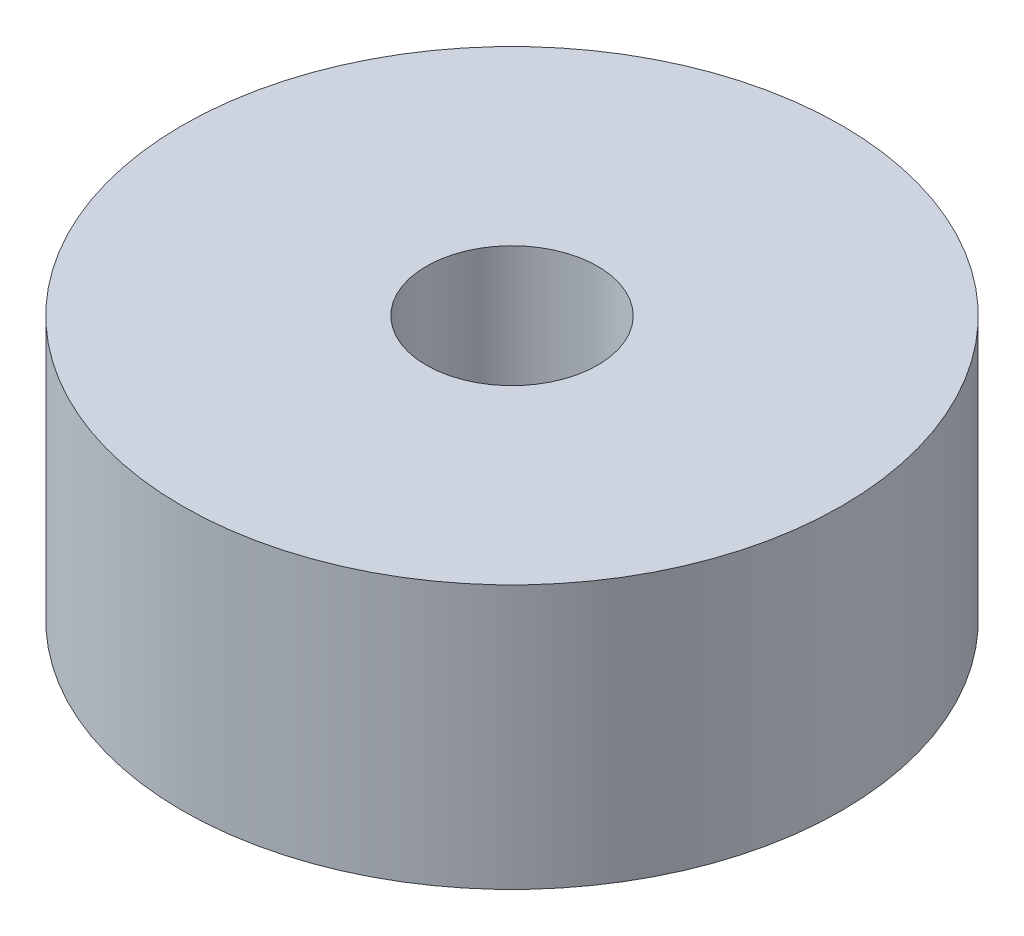
ISO-10303-21;
HEADER;
FILE_DESCRIPTION(('STEP AP214'),'2;1');
FILE_NAME('part.step','',(''),(''),'','','');
FILE_SCHEMA(('AUTOMOTIVE_DESIGN { 1 0 10303 214 1 1 1 1 }'));
ENDSEC;
DATA;
#1=APPLICATION_CONTEXT('core data for automotive mechanical design processes');
#2=APPLICATION_PROTOCOL_DEFINITION('international standard','automotive_design',2000,#1);
#3=PRODUCT_CONTEXT('',#1,'mechanical');
#4=PRODUCT('Part','Part','',(#3));
#5=PRODUCT_RELATED_PRODUCT_CATEGORY('part','',(#4));
#6=PRODUCT_DEFINITION_FORMATION('','',#4);
#7=PRODUCT_DEFINITION_CONTEXT('part definition',#1,'design');
#8=PRODUCT_DEFINITION('design','',#6,#7);
#9=PRODUCT_DEFINITION_SHAPE('','',#8);
#10=(LENGTH_UNIT() NAMED_UNIT(*) SI_UNIT(.MILLI.,.METRE.));
#11=(NAMED_UNIT(*) PLANE_ANGLE_UNIT() SI_UNIT($,.RADIAN.));
#12=(NAMED_UNIT(*) SI_UNIT($,.STERADIAN.) SOLID_ANGLE_UNIT());
#13=UNCERTAINTY_MEASURE_WITH_UNIT(LENGTH_MEASURE(1.E-05),#10,'distance_accuracy_value','');
#14=(GEOMETRIC_REPRESENTATION_CONTEXT(3) GLOBAL_UNCERTAINTY_ASSIGNED_CONTEXT((#13)) GLOBAL_UNIT_ASSIGNED_CONTEXT((#10,
#11,#12)) REPRESENTATION_CONTEXT('',''));
#15=CARTESIAN_POINT('',(0.,0.,0.));
#16=DIRECTION('',(0.,0.,1.));
#17=DIRECTION('',(1.,0.,0.));
#18=AXIS2_PLACEMENT_3D('',#15,#16,#17);
#19=CARTESIAN_POINT('',(0.,10.,0.));
#20=DIRECTION('',(0.,-1.,0.));
#21=DIRECTION('',(0.,0.,-1.));
#22=AXIS2_PLACEMENT_3D('',#19,#20,#21);
#23=CYLINDRICAL_SURFACE('',#22,12.5);
#24=CARTESIAN_POINT('',(0.,10.,0.));
#25=DIRECTION('',(0.,1.,0.));
#26=DIRECTION('',(0.,0.,1.));
#27=AXIS2_PLACEMENT_3D('',#24,#25,#26);
#28=CIRCLE('',#27,12.5);
#29=CARTESIAN_POINT('',(0.,10.,12.5));
#30=VERTEX_POINT('',#29);
#31=EDGE_CURVE('E10',#30,#30,#28,.T.);
#32=ORIENTED_EDGE('',*,*,#31,.F.);
#33=EDGE_LOOP('',(#32));
#34=FACE_BOUND('',#33,.T.);
#35=CARTESIAN_POINT('',(0.,0.,0.));
#36=DIRECTION('',(0.,1.,0.));
#37=DIRECTION('',(0.,0.,1.));
#38=AXIS2_PLACEMENT_3D('',#35,#36,#37);
#39=CIRCLE('',#38,12.5);
#40=CARTESIAN_POINT('',(0.,0.,12.5));
#41=VERTEX_POINT('',#40);
#42=EDGE_CURVE('E42',#41,#41,#39,.T.);
#43=ORIENTED_EDGE('',*,*,#42,.T.);
#44=EDGE_LOOP('',(#43));
#45=FACE_BOUND('',#44,.T.);
#46=ADVANCED_FACE('F39',(#34,#45),#23,.T.);
#47=CARTESIAN_POINT('',(0.,10.,0.));
#48=DIRECTION('',(0.,1.,0.));
#49=DIRECTION('',(0.,0.,1.));
#50=AXIS2_PLACEMENT_3D('',#47,#48,#49);
#51=PLANE('',#50);
#52=CARTESIAN_POINT('',(0.,10.,0.));
#53=DIRECTION('',(0.,1.,0.));
#54=DIRECTION('',(0.,0.,1.));
#55=AXIS2_PLACEMENT_3D('',#52,#53,#54);
#56=CIRCLE('',#55,3.25);
#57=CARTESIAN_POINT('',(0.,10.,3.25));
#58=VERTEX_POINT('',#57);
#59=EDGE_CURVE('E51',#58,#58,#56,.T.);
#60=ORIENTED_EDGE('',*,*,#59,.F.);
#61=EDGE_LOOP('',(#60));
#62=FACE_BOUND('',#61,.T.);
#63=ORIENTED_EDGE('',*,*,#31,.T.);
#64=EDGE_LOOP('',(#63));
#65=FACE_BOUND('',#64,.T.);
#66=ADVANCED_FACE('F66',(#62,#65),#51,.T.);
#67=CARTESIAN_POINT('',(0.,0.,0.));
#68=DIRECTION('',(0.,1.,0.));
#69=DIRECTION('',(0.,0.,1.));
#70=AXIS2_PLACEMENT_3D('',#67,#68,#69);
#71=PLANE('',#70);
#72=CARTESIAN_POINT('',(0.,0.,0.));
#73=DIRECTION('',(0.,1.,0.));
#74=DIRECTION('',(0.,0.,1.));
#75=AXIS2_PLACEMENT_3D('',#72,#73,#74);
#76=CIRCLE('',#75,3.25);
#77=CARTESIAN_POINT('',(0.,0.,3.25));
#78=VERTEX_POINT('',#77);
#79=EDGE_CURVE('E49',#78,#78,#76,.T.);
#80=ORIENTED_EDGE('',*,*,#79,.T.);
#81=EDGE_LOOP('',(#80));
#82=FACE_BOUND('',#81,.T.);
#83=ORIENTED_EDGE('',*,*,#42,.F.);
#84=EDGE_LOOP('',(#83));
#85=FACE_BOUND('',#84,.T.);
#86=ADVANCED_FACE('F57',(#82,#85),#71,.F.);
#87=CARTESIAN_POINT('',(0.,0.,0.));
#88=DIRECTION('',(0.,1.,0.));
#89=DIRECTION('',(0.,0.,1.));
#90=AXIS2_PLACEMENT_3D('',#87,#88,#89);
#91=CYLINDRICAL_SURFACE('',#90,3.25);
#92=ORIENTED_EDGE('',*,*,#79,.F.);
#93=EDGE_LOOP('',(#92));
#94=FACE_BOUND('',#93,.T.);
#95=ORIENTED_EDGE('',*,*,#59,.T.);
#96=EDGE_LOOP('',(#95));
#97=FACE_BOUND('',#96,.T.);
#98=ADVANCED_FACE('F60',(#94,#97),#91,.F.);
#99=CLOSED_SHELL('',(#46,#66,#86,#98));
#100=MANIFOLD_SOLID_BREP('B2',#99);
#101=ADVANCED_BREP_SHAPE_REPRESENTATION('',(#18,#100),#14);
#102=SHAPE_DEFINITION_REPRESENTATION(#9,#101);
ENDSEC;
END-ISO-10303-21;
